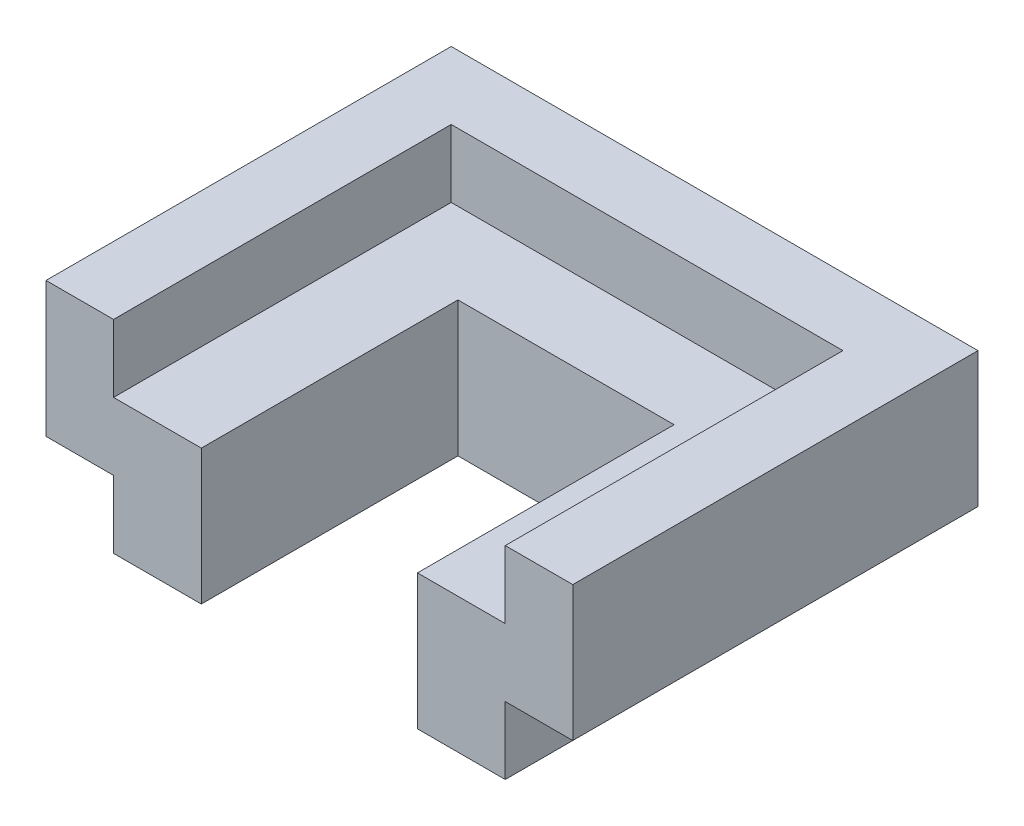
ISO-10303-21;
HEADER;
FILE_DESCRIPTION(('STEP AP214'),'2;1');
FILE_NAME('part.step','',(''),(''),'','','');
FILE_SCHEMA(('AUTOMOTIVE_DESIGN { 1 0 10303 214 1 1 1 1 }'));
ENDSEC;
DATA;
#1=APPLICATION_CONTEXT('core data for automotive mechanical design processes');
#2=APPLICATION_PROTOCOL_DEFINITION('international standard','automotive_design',2000,#1);
#3=PRODUCT_CONTEXT('',#1,'mechanical');
#4=PRODUCT('Part','Part','',(#3));
#5=PRODUCT_RELATED_PRODUCT_CATEGORY('part','',(#4));
#6=PRODUCT_DEFINITION_FORMATION('','',#4);
#7=PRODUCT_DEFINITION_CONTEXT('part definition',#1,'design');
#8=PRODUCT_DEFINITION('design','',#6,#7);
#9=PRODUCT_DEFINITION_SHAPE('','',#8);
#10=(LENGTH_UNIT() NAMED_UNIT(*) SI_UNIT(.MILLI.,.METRE.));
#11=(NAMED_UNIT(*) PLANE_ANGLE_UNIT() SI_UNIT($,.RADIAN.));
#12=(NAMED_UNIT(*) SI_UNIT($,.STERADIAN.) SOLID_ANGLE_UNIT());
#13=UNCERTAINTY_MEASURE_WITH_UNIT(LENGTH_MEASURE(1.E-05),#10,'distance_accuracy_value','');
#14=(GEOMETRIC_REPRESENTATION_CONTEXT(3) GLOBAL_UNCERTAINTY_ASSIGNED_CONTEXT((#13)) GLOBAL_UNIT_ASSIGNED_CONTEXT((#10,
#11,#12)) REPRESENTATION_CONTEXT('',''));
#15=CARTESIAN_POINT('',(0.,0.,0.));
#16=DIRECTION('',(0.,0.,1.));
#17=DIRECTION('',(1.,0.,0.));
#18=AXIS2_PLACEMENT_3D('',#15,#16,#17);
#19=CARTESIAN_POINT('',(-8.,10.,0.));
#20=DIRECTION('',(-1.,0.,0.));
#21=DIRECTION('',(0.,0.,1.));
#22=AXIS2_PLACEMENT_3D('',#19,#20,#21);
#23=PLANE('',#22);
#24=DIRECTION('',(0.,0.,-1.));
#25=VECTOR('',#24,1.);
#26=CARTESIAN_POINT('',(-8.,10.,0.));
#27=LINE('',#26,#25);
#28=CARTESIAN_POINT('',(-8.,10.,0.));
#29=VERTEX_POINT('',#28);
#30=CARTESIAN_POINT('',(-8.,10.,-19.));
#31=VERTEX_POINT('',#30);
#32=EDGE_CURVE('E197',#29,#31,#27,.T.);
#33=ORIENTED_EDGE('',*,*,#32,.F.);
#34=DIRECTION('',(0.,-1.,0.));
#35=VECTOR('',#34,1.);
#36=CARTESIAN_POINT('',(-8.,10.,0.));
#37=LINE('',#36,#35);
#38=CARTESIAN_POINT('',(-8.,0.,0.));
#39=VERTEX_POINT('',#38);
#40=EDGE_CURVE('E309',#29,#39,#37,.T.);
#41=ORIENTED_EDGE('',*,*,#40,.T.);
#42=DIRECTION('',(0.,0.,-1.));
#43=VECTOR('',#42,1.);
#44=CARTESIAN_POINT('',(-8.,0.,0.));
#45=LINE('',#44,#43);
#46=CARTESIAN_POINT('',(-8.,0.,-19.));
#47=VERTEX_POINT('',#46);
#48=EDGE_CURVE('E267',#39,#47,#45,.T.);
#49=ORIENTED_EDGE('',*,*,#48,.T.);
#50=DIRECTION('',(0.,-1.,0.));
#51=VECTOR('',#50,1.);
#52=CARTESIAN_POINT('',(-8.,10.,-19.));
#53=LINE('',#52,#51);
#54=EDGE_CURVE('E306',#31,#47,#53,.T.);
#55=ORIENTED_EDGE('',*,*,#54,.F.);
#56=EDGE_LOOP('',(#33,#41,#49,#55));
#57=FACE_BOUND('',#56,.T.);
#58=ADVANCED_FACE('F39',(#57),#23,.F.);
#59=CARTESIAN_POINT('',(-8.,10.,-19.));
#60=DIRECTION('',(0.,0.,-1.));
#61=DIRECTION('',(-1.,0.,0.));
#62=AXIS2_PLACEMENT_3D('',#59,#60,#61);
#63=PLANE('',#62);
#64=DIRECTION('',(1.,0.,0.));
#65=VECTOR('',#64,1.);
#66=CARTESIAN_POINT('',(-8.,10.,-19.));
#67=LINE('',#66,#65);
#68=CARTESIAN_POINT('',(8.,10.,-19.));
#69=VERTEX_POINT('',#68);
#70=EDGE_CURVE('E194',#31,#69,#67,.T.);
#71=ORIENTED_EDGE('',*,*,#70,.F.);
#72=ORIENTED_EDGE('',*,*,#54,.T.);
#73=DIRECTION('',(1.,0.,0.));
#74=VECTOR('',#73,1.);
#75=CARTESIAN_POINT('',(-8.,0.,-19.));
#76=LINE('',#75,#74);
#77=CARTESIAN_POINT('',(8.,0.,-19.));
#78=VERTEX_POINT('',#77);
#79=EDGE_CURVE('E271',#47,#78,#76,.T.);
#80=ORIENTED_EDGE('',*,*,#79,.T.);
#81=DIRECTION('',(0.,-1.,0.));
#82=VECTOR('',#81,1.);
#83=CARTESIAN_POINT('',(8.,10.,-19.));
#84=LINE('',#83,#82);
#85=EDGE_CURVE('E303',#69,#78,#84,.T.);
#86=ORIENTED_EDGE('',*,*,#85,.F.);
#87=EDGE_LOOP('',(#71,#72,#80,#86));
#88=FACE_BOUND('',#87,.T.);
#89=ADVANCED_FACE('F357',(#88),#63,.F.);
#90=CARTESIAN_POINT('',(8.,10.,-19.));
#91=DIRECTION('',(1.,0.,0.));
#92=DIRECTION('',(0.,0.,-1.));
#93=AXIS2_PLACEMENT_3D('',#90,#91,#92);
#94=PLANE('',#93);
#95=DIRECTION('',(0.,0.,1.));
#96=VECTOR('',#95,1.);
#97=CARTESIAN_POINT('',(8.,10.,-19.));
#98=LINE('',#97,#96);
#99=CARTESIAN_POINT('',(8.,10.,0.));
#100=VERTEX_POINT('',#99);
#101=EDGE_CURVE('E191',#69,#100,#98,.T.);
#102=ORIENTED_EDGE('',*,*,#101,.F.);
#103=ORIENTED_EDGE('',*,*,#85,.T.);
#104=DIRECTION('',(0.,0.,1.));
#105=VECTOR('',#104,1.);
#106=CARTESIAN_POINT('',(8.,0.,-19.));
#107=LINE('',#106,#105);
#108=CARTESIAN_POINT('',(8.,0.,0.));
#109=VERTEX_POINT('',#108);
#110=EDGE_CURVE('E275',#78,#109,#107,.T.);
#111=ORIENTED_EDGE('',*,*,#110,.T.);
#112=DIRECTION('',(0.,-1.,0.));
#113=VECTOR('',#112,1.);
#114=CARTESIAN_POINT('',(8.,10.,0.));
#115=LINE('',#114,#113);
#116=EDGE_CURVE('E300',#100,#109,#115,.T.);
#117=ORIENTED_EDGE('',*,*,#116,.F.);
#118=EDGE_LOOP('',(#102,#103,#111,#117));
#119=FACE_BOUND('',#118,.T.);
#120=ADVANCED_FACE('F363',(#119),#94,.F.);
#121=CARTESIAN_POINT('',(-14.5,10.,-25.));
#122=DIRECTION('',(1.,0.,0.));
#123=DIRECTION('',(0.,0.,-1.));
#124=AXIS2_PLACEMENT_3D('',#121,#122,#123);
#125=PLANE('',#124);
#126=DIRECTION('',(0.,-1.,0.));
#127=VECTOR('',#126,1.);
#128=CARTESIAN_POINT('',(-14.5,10.,0.));
#129=LINE('',#128,#127);
#130=CARTESIAN_POINT('',(-14.5,5.,0.));
#131=VERTEX_POINT('',#130);
#132=CARTESIAN_POINT('',(-14.5,0.,0.));
#133=VERTEX_POINT('',#132);
#134=EDGE_CURVE('E63',#131,#133,#129,.T.);
#135=ORIENTED_EDGE('',*,*,#134,.F.);
#136=DIRECTION('',(0.,0.,-1.));
#137=VECTOR('',#136,1.);
#138=CARTESIAN_POINT('',(-14.5,5.,-25.));
#139=LINE('',#138,#137);
#140=CARTESIAN_POINT('',(-14.5,5.,-25.));
#141=VERTEX_POINT('',#140);
#142=EDGE_CURVE('E257',#131,#141,#139,.T.);
#143=ORIENTED_EDGE('',*,*,#142,.T.);
#144=DIRECTION('',(0.,-1.,0.));
#145=VECTOR('',#144,1.);
#146=CARTESIAN_POINT('',(-14.5,10.,-25.));
#147=LINE('',#146,#145);
#148=CARTESIAN_POINT('',(-14.5,0.,-25.));
#149=VERTEX_POINT('',#148);
#150=EDGE_CURVE('E291',#141,#149,#147,.T.);
#151=ORIENTED_EDGE('',*,*,#150,.T.);
#152=DIRECTION('',(0.,0.,1.));
#153=VECTOR('',#152,1.);
#154=CARTESIAN_POINT('',(-14.5,0.,-25.));
#155=LINE('',#154,#153);
#156=EDGE_CURVE('E260',#149,#133,#155,.T.);
#157=ORIENTED_EDGE('',*,*,#156,.T.);
#158=EDGE_LOOP('',(#135,#143,#151,#157));
#159=FACE_BOUND('',#158,.T.);
#160=ADVANCED_FACE('F41',(#159),#125,.F.);
#161=CARTESIAN_POINT('',(-14.5,10.,0.));
#162=DIRECTION('',(0.,0.,-1.));
#163=DIRECTION('',(-1.,0.,0.));
#164=AXIS2_PLACEMENT_3D('',#161,#162,#163);
#165=PLANE('',#164);
#166=DIRECTION('',(1.,0.,0.));
#167=VECTOR('',#166,1.);
#168=CARTESIAN_POINT('',(-14.5,10.,0.));
#169=LINE('',#168,#167);
#170=CARTESIAN_POINT('',(-14.5,10.,0.));
#171=VERTEX_POINT('',#170);
#172=EDGE_CURVE('E200',#171,#29,#169,.T.);
#173=ORIENTED_EDGE('',*,*,#172,.F.);
#174=DIRECTION('',(0.,1.,0.));
#175=VECTOR('',#174,1.);
#176=CARTESIAN_POINT('',(-14.5,10.,0.));
#177=LINE('',#176,#175);
#178=CARTESIAN_POINT('',(-14.5,15.,0.));
#179=VERTEX_POINT('',#178);
#180=EDGE_CURVE('E187',#171,#179,#177,.T.);
#181=ORIENTED_EDGE('',*,*,#180,.T.);
#182=DIRECTION('',(1.,0.,0.));
#183=VECTOR('',#182,1.);
#184=CARTESIAN_POINT('',(-8.,15.,0.));
#185=LINE('',#184,#183);
#186=CARTESIAN_POINT('',(-19.5,15.,0.));
#187=VERTEX_POINT('',#186);
#188=EDGE_CURVE('E218',#187,#179,#185,.T.);
#189=ORIENTED_EDGE('',*,*,#188,.F.);
#190=DIRECTION('',(0.,1.,0.));
#191=VECTOR('',#190,1.);
#192=CARTESIAN_POINT('',(-19.5,5.,0.));
#193=LINE('',#192,#191);
#194=CARTESIAN_POINT('',(-19.5,5.,0.));
#195=VERTEX_POINT('',#194);
#196=EDGE_CURVE('E242',#195,#187,#193,.T.);
#197=ORIENTED_EDGE('',*,*,#196,.F.);
#198=DIRECTION('',(1.,0.,0.));
#199=VECTOR('',#198,1.);
#200=CARTESIAN_POINT('',(-8.,5.,0.));
#201=LINE('',#200,#199);
#202=EDGE_CURVE('E237',#195,#131,#201,.T.);
#203=ORIENTED_EDGE('',*,*,#202,.T.);
#204=ORIENTED_EDGE('',*,*,#134,.T.);
#205=DIRECTION('',(1.,0.,0.));
#206=VECTOR('',#205,1.);
#207=CARTESIAN_POINT('',(-14.5,0.,0.));
#208=LINE('',#207,#206);
#209=EDGE_CURVE('E263',#133,#39,#208,.T.);
#210=ORIENTED_EDGE('',*,*,#209,.T.);
#211=ORIENTED_EDGE('',*,*,#40,.F.);
#212=EDGE_LOOP('',(#173,#181,#189,#197,#203,#204,#210,#211));
#213=FACE_BOUND('',#212,.T.);
#214=ADVANCED_FACE('F344',(#213),#165,.F.);
#215=CARTESIAN_POINT('',(8.,10.,0.));
#216=DIRECTION('',(0.,0.,-1.));
#217=DIRECTION('',(-1.,0.,0.));
#218=AXIS2_PLACEMENT_3D('',#215,#216,#217);
#219=PLANE('',#218);
#220=DIRECTION('',(1.,0.,0.));
#221=VECTOR('',#220,1.);
#222=CARTESIAN_POINT('',(19.5,15.,0.));
#223=LINE('',#222,#221);
#224=CARTESIAN_POINT('',(14.5,15.,0.));
#225=VERTEX_POINT('',#224);
#226=CARTESIAN_POINT('',(19.5,15.,0.));
#227=VERTEX_POINT('',#226);
#228=EDGE_CURVE('E203',#225,#227,#223,.T.);
#229=ORIENTED_EDGE('',*,*,#228,.F.);
#230=DIRECTION('',(0.,-1.,0.));
#231=VECTOR('',#230,1.);
#232=CARTESIAN_POINT('',(14.5,10.,0.));
#233=LINE('',#232,#231);
#234=CARTESIAN_POINT('',(14.5,10.,0.));
#235=VERTEX_POINT('',#234);
#236=EDGE_CURVE('E55',#225,#235,#233,.T.);
#237=ORIENTED_EDGE('',*,*,#236,.T.);
#238=DIRECTION('',(1.,0.,0.));
#239=VECTOR('',#238,1.);
#240=CARTESIAN_POINT('',(8.,10.,0.));
#241=LINE('',#240,#239);
#242=EDGE_CURVE('E11',#100,#235,#241,.T.);
#243=ORIENTED_EDGE('',*,*,#242,.F.);
#244=ORIENTED_EDGE('',*,*,#116,.T.);
#245=DIRECTION('',(1.,0.,0.));
#246=VECTOR('',#245,1.);
#247=CARTESIAN_POINT('',(8.,0.,0.));
#248=LINE('',#247,#246);
#249=CARTESIAN_POINT('',(14.5,0.,0.));
#250=VERTEX_POINT('',#249);
#251=EDGE_CURVE('E279',#109,#250,#248,.T.);
#252=ORIENTED_EDGE('',*,*,#251,.T.);
#253=DIRECTION('',(0.,-1.,0.));
#254=VECTOR('',#253,1.);
#255=CARTESIAN_POINT('',(14.5,10.,0.));
#256=LINE('',#255,#254);
#257=CARTESIAN_POINT('',(14.5,5.,0.));
#258=VERTEX_POINT('',#257);
#259=EDGE_CURVE('E297',#258,#250,#256,.T.);
#260=ORIENTED_EDGE('',*,*,#259,.F.);
#261=DIRECTION('',(1.,0.,0.));
#262=VECTOR('',#261,1.);
#263=CARTESIAN_POINT('',(19.5,5.,0.));
#264=LINE('',#263,#262);
#265=CARTESIAN_POINT('',(19.5,5.,0.));
#266=VERTEX_POINT('',#265);
#267=EDGE_CURVE('E222',#258,#266,#264,.T.);
#268=ORIENTED_EDGE('',*,*,#267,.T.);
#269=DIRECTION('',(0.,1.,0.));
#270=VECTOR('',#269,1.);
#271=CARTESIAN_POINT('',(19.5,5.,0.));
#272=LINE('',#271,#270);
#273=EDGE_CURVE('E241',#266,#227,#272,.T.);
#274=ORIENTED_EDGE('',*,*,#273,.T.);
#275=EDGE_LOOP('',(#229,#237,#243,#244,#252,#260,#268,#274));
#276=FACE_BOUND('',#275,.T.);
#277=ADVANCED_FACE('F322',(#276),#219,.F.);
#278=CARTESIAN_POINT('',(14.5,10.,0.));
#279=DIRECTION('',(-1.,0.,0.));
#280=DIRECTION('',(0.,0.,1.));
#281=AXIS2_PLACEMENT_3D('',#278,#279,#280);
#282=PLANE('',#281);
#283=DIRECTION('',(0.,-1.,0.));
#284=VECTOR('',#283,1.);
#285=CARTESIAN_POINT('',(14.5,10.,-25.));
#286=LINE('',#285,#284);
#287=CARTESIAN_POINT('',(14.5,5.,-25.));
#288=VERTEX_POINT('',#287);
#289=CARTESIAN_POINT('',(14.5,0.,-25.));
#290=VERTEX_POINT('',#289);
#291=EDGE_CURVE('E294',#288,#290,#286,.T.);
#292=ORIENTED_EDGE('',*,*,#291,.F.);
#293=DIRECTION('',(0.,0.,1.));
#294=VECTOR('',#293,1.);
#295=CARTESIAN_POINT('',(14.5,5.,0.));
#296=LINE('',#295,#294);
#297=EDGE_CURVE('E245',#288,#258,#296,.T.);
#298=ORIENTED_EDGE('',*,*,#297,.T.);
#299=ORIENTED_EDGE('',*,*,#259,.T.);
#300=DIRECTION('',(0.,0.,-1.));
#301=VECTOR('',#300,1.);
#302=CARTESIAN_POINT('',(14.5,0.,0.));
#303=LINE('',#302,#301);
#304=EDGE_CURVE('E283',#250,#290,#303,.T.);
#305=ORIENTED_EDGE('',*,*,#304,.T.);
#306=EDGE_LOOP('',(#292,#298,#299,#305));
#307=FACE_BOUND('',#306,.T.);
#308=ADVANCED_FACE('F372',(#307),#282,.F.);
#309=CARTESIAN_POINT('',(14.5,10.,-25.));
#310=DIRECTION('',(0.,0.,1.));
#311=DIRECTION('',(1.,0.,0.));
#312=AXIS2_PLACEMENT_3D('',#309,#310,#311);
#313=PLANE('',#312);
#314=ORIENTED_EDGE('',*,*,#150,.F.);
#315=DIRECTION('',(1.,0.,0.));
#316=VECTOR('',#315,1.);
#317=CARTESIAN_POINT('',(14.5,5.,-25.));
#318=LINE('',#317,#316);
#319=EDGE_CURVE('E314',#141,#288,#318,.T.);
#320=ORIENTED_EDGE('',*,*,#319,.T.);
#321=ORIENTED_EDGE('',*,*,#291,.T.);
#322=DIRECTION('',(-1.,0.,0.));
#323=VECTOR('',#322,1.);
#324=CARTESIAN_POINT('',(14.5,0.,-25.));
#325=LINE('',#324,#323);
#326=EDGE_CURVE('E287',#290,#149,#325,.T.);
#327=ORIENTED_EDGE('',*,*,#326,.T.);
#328=EDGE_LOOP('',(#314,#320,#321,#327));
#329=FACE_BOUND('',#328,.T.);
#330=ADVANCED_FACE('F376',(#329),#313,.F.);
#331=CARTESIAN_POINT('',(0.,0.,0.));
#332=DIRECTION('',(0.,1.,0.));
#333=DIRECTION('',(0.,0.,1.));
#334=AXIS2_PLACEMENT_3D('',#331,#332,#333);
#335=PLANE('',#334);
#336=ORIENTED_EDGE('',*,*,#156,.F.);
#337=ORIENTED_EDGE('',*,*,#326,.F.);
#338=ORIENTED_EDGE('',*,*,#304,.F.);
#339=ORIENTED_EDGE('',*,*,#251,.F.);
#340=ORIENTED_EDGE('',*,*,#110,.F.);
#341=ORIENTED_EDGE('',*,*,#79,.F.);
#342=ORIENTED_EDGE('',*,*,#48,.F.);
#343=ORIENTED_EDGE('',*,*,#209,.F.);
#344=EDGE_LOOP('',(#336,#337,#338,#339,#340,#341,#342,#343));
#345=FACE_BOUND('',#344,.T.);
#346=ADVANCED_FACE('F369',(#345),#335,.F.);
#347=CARTESIAN_POINT('',(0.,5.,0.));
#348=DIRECTION('',(0.,-1.,0.));
#349=DIRECTION('',(0.,0.,-1.));
#350=AXIS2_PLACEMENT_3D('',#347,#348,#349);
#351=PLANE('',#350);
#352=ORIENTED_EDGE('',*,*,#142,.F.);
#353=ORIENTED_EDGE('',*,*,#202,.F.);
#354=DIRECTION('',(0.,0.,1.));
#355=VECTOR('',#354,1.);
#356=CARTESIAN_POINT('',(-19.5,5.,0.));
#357=LINE('',#356,#355);
#358=CARTESIAN_POINT('',(-19.5,5.,-30.));
#359=VERTEX_POINT('',#358);
#360=EDGE_CURVE('E233',#359,#195,#357,.T.);
#361=ORIENTED_EDGE('',*,*,#360,.F.);
#362=DIRECTION('',(-1.,0.,0.));
#363=VECTOR('',#362,1.);
#364=CARTESIAN_POINT('',(-19.5,5.,-30.));
#365=LINE('',#364,#363);
#366=CARTESIAN_POINT('',(19.5,5.,-30.));
#367=VERTEX_POINT('',#366);
#368=EDGE_CURVE('E229',#367,#359,#365,.T.);
#369=ORIENTED_EDGE('',*,*,#368,.F.);
#370=DIRECTION('',(0.,0.,-1.));
#371=VECTOR('',#370,1.);
#372=CARTESIAN_POINT('',(19.5,5.,-30.));
#373=LINE('',#372,#371);
#374=EDGE_CURVE('E225',#266,#367,#373,.T.);
#375=ORIENTED_EDGE('',*,*,#374,.F.);
#376=ORIENTED_EDGE('',*,*,#267,.F.);
#377=ORIENTED_EDGE('',*,*,#297,.F.);
#378=ORIENTED_EDGE('',*,*,#319,.F.);
#379=EDGE_LOOP('',(#352,#353,#361,#369,#375,#376,#377,#378));
#380=FACE_BOUND('',#379,.T.);
#381=ADVANCED_FACE('F340',(#380),#351,.T.);
#382=CARTESIAN_POINT('',(-19.5,5.,0.));
#383=DIRECTION('',(-1.,0.,0.));
#384=DIRECTION('',(0.,0.,1.));
#385=AXIS2_PLACEMENT_3D('',#382,#383,#384);
#386=PLANE('',#385);
#387=ORIENTED_EDGE('',*,*,#196,.T.);
#388=DIRECTION('',(0.,0.,1.));
#389=VECTOR('',#388,1.);
#390=CARTESIAN_POINT('',(-19.5,15.,0.));
#391=LINE('',#390,#389);
#392=CARTESIAN_POINT('',(-19.5,15.,-30.));
#393=VERTEX_POINT('',#392);
#394=EDGE_CURVE('E214',#393,#187,#391,.T.);
#395=ORIENTED_EDGE('',*,*,#394,.F.);
#396=DIRECTION('',(0.,1.,0.));
#397=VECTOR('',#396,1.);
#398=CARTESIAN_POINT('',(-19.5,5.,-30.));
#399=LINE('',#398,#397);
#400=EDGE_CURVE('E246',#359,#393,#399,.T.);
#401=ORIENTED_EDGE('',*,*,#400,.F.);
#402=ORIENTED_EDGE('',*,*,#360,.T.);
#403=EDGE_LOOP('',(#387,#395,#401,#402));
#404=FACE_BOUND('',#403,.T.);
#405=ADVANCED_FACE('F337',(#404),#386,.T.);
#406=CARTESIAN_POINT('',(-19.5,5.,-30.));
#407=DIRECTION('',(0.,0.,-1.));
#408=DIRECTION('',(-1.,0.,0.));
#409=AXIS2_PLACEMENT_3D('',#406,#407,#408);
#410=PLANE('',#409);
#411=ORIENTED_EDGE('',*,*,#400,.T.);
#412=DIRECTION('',(-1.,0.,0.));
#413=VECTOR('',#412,1.);
#414=CARTESIAN_POINT('',(-19.5,15.,-30.));
#415=LINE('',#414,#413);
#416=CARTESIAN_POINT('',(19.5,15.,-30.));
#417=VERTEX_POINT('',#416);
#418=EDGE_CURVE('E210',#417,#393,#415,.T.);
#419=ORIENTED_EDGE('',*,*,#418,.F.);
#420=DIRECTION('',(0.,1.,0.));
#421=VECTOR('',#420,1.);
#422=CARTESIAN_POINT('',(19.5,5.,-30.));
#423=LINE('',#422,#421);
#424=EDGE_CURVE('E249',#367,#417,#423,.T.);
#425=ORIENTED_EDGE('',*,*,#424,.F.);
#426=ORIENTED_EDGE('',*,*,#368,.T.);
#427=EDGE_LOOP('',(#411,#419,#425,#426));
#428=FACE_BOUND('',#427,.T.);
#429=ADVANCED_FACE('F333',(#428),#410,.T.);
#430=CARTESIAN_POINT('',(19.5,5.,-30.));
#431=DIRECTION('',(1.,0.,0.));
#432=DIRECTION('',(0.,0.,-1.));
#433=AXIS2_PLACEMENT_3D('',#430,#431,#432);
#434=PLANE('',#433);
#435=ORIENTED_EDGE('',*,*,#424,.T.);
#436=DIRECTION('',(0.,0.,-1.));
#437=VECTOR('',#436,1.);
#438=CARTESIAN_POINT('',(19.5,15.,-30.));
#439=LINE('',#438,#437);
#440=EDGE_CURVE('E206',#227,#417,#439,.T.);
#441=ORIENTED_EDGE('',*,*,#440,.F.);
#442=ORIENTED_EDGE('',*,*,#273,.F.);
#443=ORIENTED_EDGE('',*,*,#374,.T.);
#444=EDGE_LOOP('',(#435,#441,#442,#443));
#445=FACE_BOUND('',#444,.T.);
#446=ADVANCED_FACE('F329',(#445),#434,.T.);
#447=CARTESIAN_POINT('',(0.,15.,0.));
#448=DIRECTION('',(0.,-1.,0.));
#449=DIRECTION('',(0.,0.,-1.));
#450=AXIS2_PLACEMENT_3D('',#447,#448,#449);
#451=PLANE('',#450);
#452=ORIENTED_EDGE('',*,*,#188,.T.);
#453=DIRECTION('',(0.,0.,1.));
#454=VECTOR('',#453,1.);
#455=CARTESIAN_POINT('',(-14.5,15.,25.));
#456=LINE('',#455,#454);
#457=CARTESIAN_POINT('',(-14.5,15.,-25.));
#458=VERTEX_POINT('',#457);
#459=EDGE_CURVE('E177',#458,#179,#456,.T.);
#460=ORIENTED_EDGE('',*,*,#459,.F.);
#461=DIRECTION('',(-1.,0.,0.));
#462=VECTOR('',#461,1.);
#463=CARTESIAN_POINT('',(14.5,15.,-25.));
#464=LINE('',#463,#462);
#465=CARTESIAN_POINT('',(14.5,15.,-25.));
#466=VERTEX_POINT('',#465);
#467=EDGE_CURVE('E180',#466,#458,#464,.T.);
#468=ORIENTED_EDGE('',*,*,#467,.F.);
#469=DIRECTION('',(0.,0.,1.));
#470=VECTOR('',#469,1.);
#471=CARTESIAN_POINT('',(14.5,15.,0.));
#472=LINE('',#471,#470);
#473=EDGE_CURVE('E48',#466,#225,#472,.T.);
#474=ORIENTED_EDGE('',*,*,#473,.T.);
#475=ORIENTED_EDGE('',*,*,#228,.T.);
#476=ORIENTED_EDGE('',*,*,#440,.T.);
#477=ORIENTED_EDGE('',*,*,#418,.T.);
#478=ORIENTED_EDGE('',*,*,#394,.T.);
#479=EDGE_LOOP('',(#452,#460,#468,#474,#475,#476,#477,#478));
#480=FACE_BOUND('',#479,.T.);
#481=ADVANCED_FACE('F319',(#480),#451,.F.);
#482=CARTESIAN_POINT('',(0.,10.,0.));
#483=DIRECTION('',(0.,1.,0.));
#484=DIRECTION('',(0.,0.,1.));
#485=AXIS2_PLACEMENT_3D('',#482,#483,#484);
#486=PLANE('',#485);
#487=ORIENTED_EDGE('',*,*,#172,.T.);
#488=ORIENTED_EDGE('',*,*,#32,.T.);
#489=ORIENTED_EDGE('',*,*,#70,.T.);
#490=ORIENTED_EDGE('',*,*,#101,.T.);
#491=ORIENTED_EDGE('',*,*,#242,.T.);
#492=DIRECTION('',(0.,0.,-1.));
#493=VECTOR('',#492,1.);
#494=CARTESIAN_POINT('',(14.5,10.,25.));
#495=LINE('',#494,#493);
#496=CARTESIAN_POINT('',(14.5,10.,-25.));
#497=VERTEX_POINT('',#496);
#498=EDGE_CURVE('E152',#235,#497,#495,.T.);
#499=ORIENTED_EDGE('',*,*,#498,.T.);
#500=DIRECTION('',(-1.,0.,0.));
#501=VECTOR('',#500,1.);
#502=CARTESIAN_POINT('',(14.5,10.,-25.));
#503=LINE('',#502,#501);
#504=CARTESIAN_POINT('',(-14.5,10.,-25.));
#505=VERTEX_POINT('',#504);
#506=EDGE_CURVE('E157',#497,#505,#503,.T.);
#507=ORIENTED_EDGE('',*,*,#506,.T.);
#508=DIRECTION('',(0.,0.,1.));
#509=VECTOR('',#508,1.);
#510=CARTESIAN_POINT('',(-14.5,10.,25.));
#511=LINE('',#510,#509);
#512=EDGE_CURVE('E160',#505,#171,#511,.T.);
#513=ORIENTED_EDGE('',*,*,#512,.T.);
#514=EDGE_LOOP('',(#487,#488,#489,#490,#491,#499,#507,#513));
#515=FACE_BOUND('',#514,.T.);
#516=ADVANCED_FACE('F154',(#515),#486,.T.);
#517=CARTESIAN_POINT('',(-14.5,10.,25.));
#518=DIRECTION('',(-1.,0.,0.));
#519=DIRECTION('',(0.,0.,1.));
#520=AXIS2_PLACEMENT_3D('',#517,#518,#519);
#521=PLANE('',#520);
#522=ORIENTED_EDGE('',*,*,#512,.F.);
#523=DIRECTION('',(0.,1.,0.));
#524=VECTOR('',#523,1.);
#525=CARTESIAN_POINT('',(-14.5,10.,-25.));
#526=LINE('',#525,#524);
#527=EDGE_CURVE('E169',#505,#458,#526,.T.);
#528=ORIENTED_EDGE('',*,*,#527,.T.);
#529=ORIENTED_EDGE('',*,*,#459,.T.);
#530=ORIENTED_EDGE('',*,*,#180,.F.);
#531=EDGE_LOOP('',(#522,#528,#529,#530));
#532=FACE_BOUND('',#531,.T.);
#533=ADVANCED_FACE('F348',(#532),#521,.F.);
#534=CARTESIAN_POINT('',(14.5,10.,25.));
#535=DIRECTION('',(1.,0.,0.));
#536=DIRECTION('',(0.,0.,-1.));
#537=AXIS2_PLACEMENT_3D('',#534,#535,#536);
#538=PLANE('',#537);
#539=ORIENTED_EDGE('',*,*,#473,.F.);
#540=DIRECTION('',(0.,1.,0.));
#541=VECTOR('',#540,1.);
#542=CARTESIAN_POINT('',(14.5,10.,-25.));
#543=LINE('',#542,#541);
#544=EDGE_CURVE('E163',#497,#466,#543,.T.);
#545=ORIENTED_EDGE('',*,*,#544,.F.);
#546=ORIENTED_EDGE('',*,*,#498,.F.);
#547=ORIENTED_EDGE('',*,*,#236,.F.);
#548=EDGE_LOOP('',(#539,#545,#546,#547));
#549=FACE_BOUND('',#548,.T.);
#550=ADVANCED_FACE('F164',(#549),#538,.F.);
#551=CARTESIAN_POINT('',(14.5,10.,-25.));
#552=DIRECTION('',(0.,0.,-1.));
#553=DIRECTION('',(-1.,0.,0.));
#554=AXIS2_PLACEMENT_3D('',#551,#552,#553);
#555=PLANE('',#554);
#556=ORIENTED_EDGE('',*,*,#467,.T.);
#557=ORIENTED_EDGE('',*,*,#527,.F.);
#558=ORIENTED_EDGE('',*,*,#506,.F.);
#559=ORIENTED_EDGE('',*,*,#544,.T.);
#560=EDGE_LOOP('',(#556,#557,#558,#559));
#561=FACE_BOUND('',#560,.T.);
#562=ADVANCED_FACE('F171',(#561),#555,.F.);
#563=CLOSED_SHELL('',(#58,#89,#120,#160,#214,#277,#308,#330,#346,#381,#405,#429,#446,#481,#516,
#533,#550,#562));
#564=MANIFOLD_SOLID_BREP('B2',#563);
#565=ADVANCED_BREP_SHAPE_REPRESENTATION('',(#18,#564),#14);
#566=SHAPE_DEFINITION_REPRESENTATION(#9,#565);
ENDSEC;
END-ISO-10303-21;
